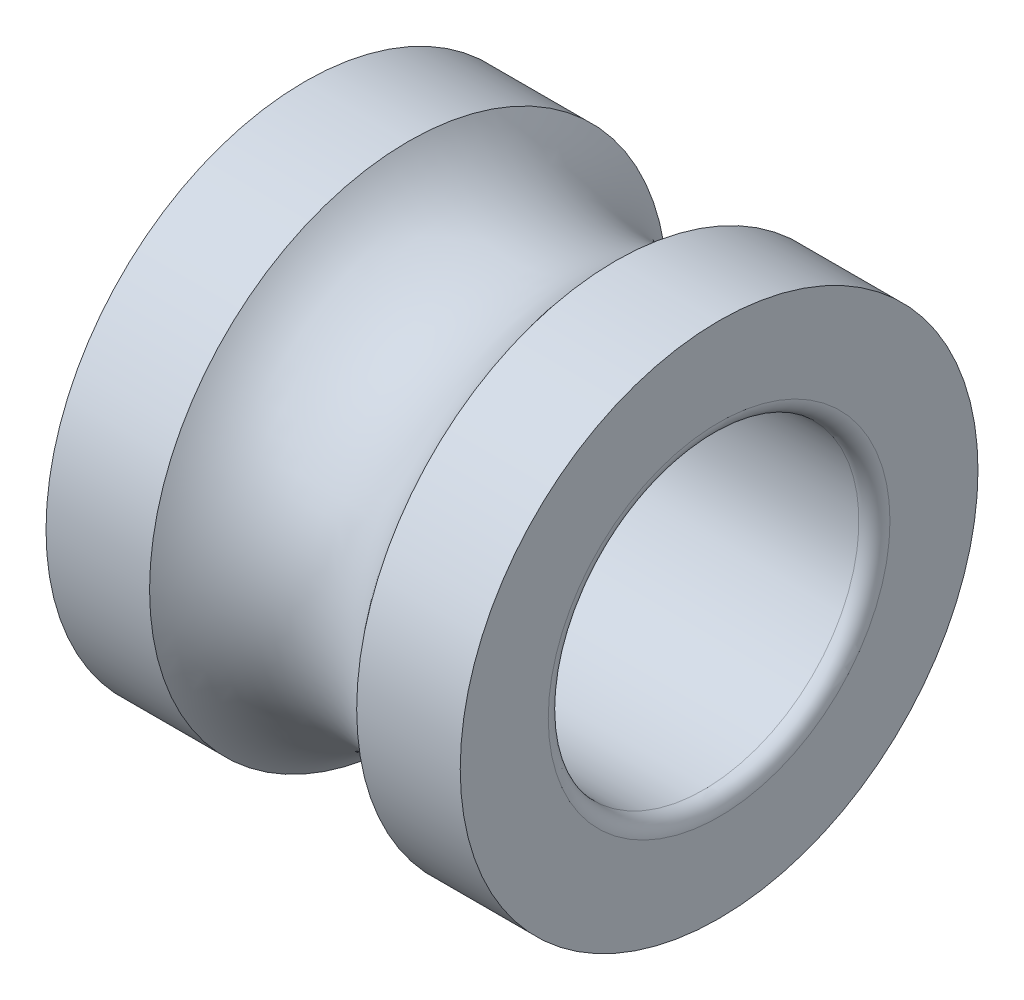
ISO-10303-21;
HEADER;
FILE_DESCRIPTION(('STEP AP214'),'2;1');
FILE_NAME('part.step','',(''),(''),'','','');
FILE_SCHEMA(('AUTOMOTIVE_DESIGN { 1 0 10303 214 1 1 1 1 }'));
ENDSEC;
DATA;
#1=APPLICATION_CONTEXT('core data for automotive mechanical design processes');
#2=APPLICATION_PROTOCOL_DEFINITION('international standard','automotive_design',2000,#1);
#3=PRODUCT_CONTEXT('',#1,'mechanical');
#4=PRODUCT('Part','Part','',(#3));
#5=PRODUCT_RELATED_PRODUCT_CATEGORY('part','',(#4));
#6=PRODUCT_DEFINITION_FORMATION('','',#4);
#7=PRODUCT_DEFINITION_CONTEXT('part definition',#1,'design');
#8=PRODUCT_DEFINITION('design','',#6,#7);
#9=PRODUCT_DEFINITION_SHAPE('','',#8);
#10=(LENGTH_UNIT() NAMED_UNIT(*) SI_UNIT(.MILLI.,.METRE.));
#11=(NAMED_UNIT(*) PLANE_ANGLE_UNIT() SI_UNIT($,.RADIAN.));
#12=(NAMED_UNIT(*) SI_UNIT($,.STERADIAN.) SOLID_ANGLE_UNIT());
#13=UNCERTAINTY_MEASURE_WITH_UNIT(LENGTH_MEASURE(1.E-05),#10,'distance_accuracy_value','');
#14=(GEOMETRIC_REPRESENTATION_CONTEXT(3) GLOBAL_UNCERTAINTY_ASSIGNED_CONTEXT((#13)) GLOBAL_UNIT_ASSIGNED_CONTEXT((#10,
#11,#12)) REPRESENTATION_CONTEXT('',''));
#15=CARTESIAN_POINT('',(0.,0.,0.));
#16=DIRECTION('',(0.,0.,1.));
#17=DIRECTION('',(1.,0.,0.));
#18=AXIS2_PLACEMENT_3D('',#15,#16,#17);
#19=CARTESIAN_POINT('',(0.,0.,0.));
#20=DIRECTION('',(-1.,0.,0.));
#21=DIRECTION('',(0.,0.,1.));
#22=AXIS2_PLACEMENT_3D('',#19,#20,#21);
#23=CYLINDRICAL_SURFACE('',#22,1.5);
#24=CARTESIAN_POINT('',(0.15,0.,0.));
#25=DIRECTION('',(1.,0.,0.));
#26=DIRECTION('',(0.,0.,-1.));
#27=AXIS2_PLACEMENT_3D('',#24,#25,#26);
#28=CIRCLE('',#27,1.5);
#29=CARTESIAN_POINT('',(0.15,0.,-1.5));
#30=VERTEX_POINT('',#29);
#31=EDGE_CURVE('E39',#30,#30,#28,.F.);
#32=ORIENTED_EDGE('',*,*,#31,.T.);
#33=EDGE_LOOP('',(#32));
#34=FACE_BOUND('',#33,.T.);
#35=CARTESIAN_POINT('',(3.85,0.,0.));
#36=DIRECTION('',(-1.,0.,0.));
#37=DIRECTION('',(0.,0.,1.));
#38=AXIS2_PLACEMENT_3D('',#35,#36,#37);
#39=CIRCLE('',#38,1.5);
#40=CARTESIAN_POINT('',(3.85,0.,1.5));
#41=VERTEX_POINT('',#40);
#42=EDGE_CURVE('E43',#41,#41,#39,.F.);
#43=ORIENTED_EDGE('',*,*,#42,.T.);
#44=EDGE_LOOP('',(#43));
#45=FACE_BOUND('',#44,.T.);
#46=ADVANCED_FACE('F29',(#34,#45),#23,.F.);
#47=CARTESIAN_POINT('',(4.,1.5,0.));
#48=DIRECTION('',(-1.,0.,0.));
#49=DIRECTION('',(0.,0.,1.));
#50=AXIS2_PLACEMENT_3D('',#47,#48,#49);
#51=PLANE('',#50);
#52=CARTESIAN_POINT('',(4.,0.,0.));
#53=DIRECTION('',(-1.,0.,0.));
#54=DIRECTION('',(0.,0.,1.));
#55=AXIS2_PLACEMENT_3D('',#52,#53,#54);
#56=CIRCLE('',#55,1.65);
#57=CARTESIAN_POINT('',(4.,0.,1.65));
#58=VERTEX_POINT('',#57);
#59=EDGE_CURVE('E10',#58,#58,#56,.T.);
#60=ORIENTED_EDGE('',*,*,#59,.T.);
#61=EDGE_LOOP('',(#60));
#62=FACE_BOUND('',#61,.T.);
#63=CARTESIAN_POINT('',(4.,0.,0.));
#64=DIRECTION('',(-1.,0.,0.));
#65=DIRECTION('',(0.,0.,1.));
#66=AXIS2_PLACEMENT_3D('',#63,#64,#65);
#67=CIRCLE('',#66,2.5);
#68=CARTESIAN_POINT('',(4.,0.,2.5));
#69=VERTEX_POINT('',#68);
#70=EDGE_CURVE('E48',#69,#69,#67,.T.);
#71=ORIENTED_EDGE('',*,*,#70,.F.);
#72=EDGE_LOOP('',(#71));
#73=FACE_BOUND('',#72,.T.);
#74=ADVANCED_FACE('F78',(#62,#73),#51,.F.);
#75=CARTESIAN_POINT('',(0.,0.,0.));
#76=DIRECTION('',(-1.,0.,0.));
#77=DIRECTION('',(0.,0.,1.));
#78=AXIS2_PLACEMENT_3D('',#75,#76,#77);
#79=CYLINDRICAL_SURFACE('',#78,2.5);
#80=CARTESIAN_POINT('',(3.,0.,0.));
#81=DIRECTION('',(-1.,0.,0.));
#82=DIRECTION('',(0.,0.,1.));
#83=AXIS2_PLACEMENT_3D('',#80,#81,#82);
#84=CIRCLE('',#83,2.5);
#85=CARTESIAN_POINT('',(3.,0.,2.5));
#86=VERTEX_POINT('',#85);
#87=EDGE_CURVE('E51',#86,#86,#84,.T.);
#88=ORIENTED_EDGE('',*,*,#87,.F.);
#89=EDGE_LOOP('',(#88));
#90=FACE_BOUND('',#89,.T.);
#91=ORIENTED_EDGE('',*,*,#70,.T.);
#92=EDGE_LOOP('',(#91));
#93=FACE_BOUND('',#92,.T.);
#94=ADVANCED_FACE('F72',(#90,#93),#79,.T.);
#95=CARTESIAN_POINT('',(2.,0.,0.));
#96=DIRECTION('',(-1.,0.,0.));
#97=DIRECTION('',(0.,0.,1.));
#98=AXIS2_PLACEMENT_3D('',#95,#96,#97);
#99=TOROIDAL_SURFACE('',#98,3.25,1.25);
#100=CARTESIAN_POINT('',(1.,0.,0.));
#101=DIRECTION('',(-1.,0.,0.));
#102=DIRECTION('',(0.,0.,1.));
#103=AXIS2_PLACEMENT_3D('',#100,#101,#102);
#104=CIRCLE('',#103,2.5);
#105=CARTESIAN_POINT('',(1.,0.,2.5));
#106=VERTEX_POINT('',#105);
#107=EDGE_CURVE('E54',#106,#106,#104,.T.);
#108=ORIENTED_EDGE('',*,*,#107,.F.);
#109=EDGE_LOOP('',(#108));
#110=FACE_BOUND('',#109,.T.);
#111=ORIENTED_EDGE('',*,*,#87,.T.);
#112=EDGE_LOOP('',(#111));
#113=FACE_BOUND('',#112,.T.);
#114=ADVANCED_FACE('F66',(#110,#113),#99,.F.);
#115=CARTESIAN_POINT('',(0.,0.,0.));
#116=DIRECTION('',(-1.,0.,0.));
#117=DIRECTION('',(0.,0.,1.));
#118=AXIS2_PLACEMENT_3D('',#115,#116,#117);
#119=CYLINDRICAL_SURFACE('',#118,2.5);
#120=CARTESIAN_POINT('',(0.,0.,0.));
#121=DIRECTION('',(-1.,0.,0.));
#122=DIRECTION('',(0.,0.,1.));
#123=AXIS2_PLACEMENT_3D('',#120,#121,#122);
#124=CIRCLE('',#123,2.5);
#125=CARTESIAN_POINT('',(0.,0.,2.5));
#126=VERTEX_POINT('',#125);
#127=EDGE_CURVE('E57',#126,#126,#124,.T.);
#128=ORIENTED_EDGE('',*,*,#127,.F.);
#129=EDGE_LOOP('',(#128));
#130=FACE_BOUND('',#129,.T.);
#131=ORIENTED_EDGE('',*,*,#107,.T.);
#132=EDGE_LOOP('',(#131));
#133=FACE_BOUND('',#132,.T.);
#134=ADVANCED_FACE('F63',(#130,#133),#119,.T.);
#135=CARTESIAN_POINT('',(0.,1.5,0.));
#136=DIRECTION('',(1.,0.,0.));
#137=DIRECTION('',(0.,0.,-1.));
#138=AXIS2_PLACEMENT_3D('',#135,#136,#137);
#139=PLANE('',#138);
#140=CARTESIAN_POINT('',(0.,0.,0.));
#141=DIRECTION('',(1.,0.,0.));
#142=DIRECTION('',(0.,0.,-1.));
#143=AXIS2_PLACEMENT_3D('',#140,#141,#142);
#144=CIRCLE('',#143,1.65);
#145=CARTESIAN_POINT('',(0.,0.,-1.65));
#146=VERTEX_POINT('',#145);
#147=EDGE_CURVE('E35',#146,#146,#144,.T.);
#148=ORIENTED_EDGE('',*,*,#147,.T.);
#149=EDGE_LOOP('',(#148));
#150=FACE_BOUND('',#149,.T.);
#151=ORIENTED_EDGE('',*,*,#127,.T.);
#152=EDGE_LOOP('',(#151));
#153=FACE_BOUND('',#152,.T.);
#154=ADVANCED_FACE('F61',(#150,#153),#139,.F.);
#155=CARTESIAN_POINT('',(0.15,0.,0.));
#156=DIRECTION('',(1.,0.,0.));
#157=DIRECTION('',(0.,0.,-1.));
#158=AXIS2_PLACEMENT_3D('',#155,#156,#157);
#159=TOROIDAL_SURFACE('',#158,1.65,0.15);
#160=ORIENTED_EDGE('',*,*,#147,.F.);
#161=EDGE_LOOP('',(#160));
#162=FACE_BOUND('',#161,.T.);
#163=ORIENTED_EDGE('',*,*,#31,.F.);
#164=EDGE_LOOP('',(#163));
#165=FACE_BOUND('',#164,.T.);
#166=ADVANCED_FACE('F90',(#162,#165),#159,.T.);
#167=CARTESIAN_POINT('',(3.85,0.,0.));
#168=DIRECTION('',(-1.,0.,0.));
#169=DIRECTION('',(0.,0.,1.));
#170=AXIS2_PLACEMENT_3D('',#167,#168,#169);
#171=TOROIDAL_SURFACE('',#170,1.65,0.15);
#172=ORIENTED_EDGE('',*,*,#42,.F.);
#173=EDGE_LOOP('',(#172));
#174=FACE_BOUND('',#173,.T.);
#175=ORIENTED_EDGE('',*,*,#59,.F.);
#176=EDGE_LOOP('',(#175));
#177=FACE_BOUND('',#176,.T.);
#178=ADVANCED_FACE('F93',(#174,#177),#171,.T.);
#179=CLOSED_SHELL('',(#46,#74,#94,#114,#134,#154,#166,#178));
#180=MANIFOLD_SOLID_BREP('B2',#179);
#181=ADVANCED_BREP_SHAPE_REPRESENTATION('',(#18,#180),#14);
#182=SHAPE_DEFINITION_REPRESENTATION(#9,#181);
ENDSEC;
END-ISO-10303-21;
